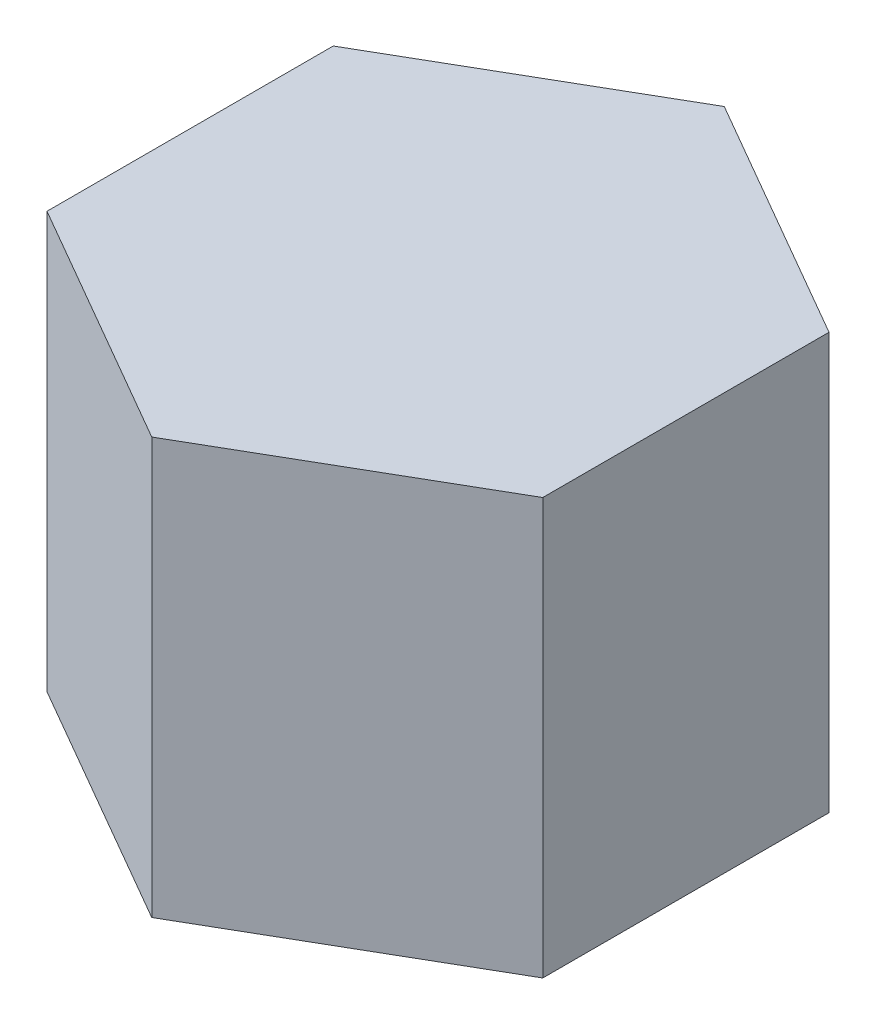
ISO-10303-21;
HEADER;
FILE_DESCRIPTION(('STEP AP214'),'2;1');
FILE_NAME('part.step','',(''),(''),'','','');
FILE_SCHEMA(('AUTOMOTIVE_DESIGN { 1 0 10303 214 1 1 1 1 }'));
ENDSEC;
DATA;
#1=APPLICATION_CONTEXT('core data for automotive mechanical design processes');
#2=APPLICATION_PROTOCOL_DEFINITION('international standard','automotive_design',2000,#1);
#3=PRODUCT_CONTEXT('',#1,'mechanical');
#4=PRODUCT('Part','Part','',(#3));
#5=PRODUCT_RELATED_PRODUCT_CATEGORY('part','',(#4));
#6=PRODUCT_DEFINITION_FORMATION('','',#4);
#7=PRODUCT_DEFINITION_CONTEXT('part definition',#1,'design');
#8=PRODUCT_DEFINITION('design','',#6,#7);
#9=PRODUCT_DEFINITION_SHAPE('','',#8);
#10=(LENGTH_UNIT() NAMED_UNIT(*) SI_UNIT(.MILLI.,.METRE.));
#11=(NAMED_UNIT(*) PLANE_ANGLE_UNIT() SI_UNIT($,.RADIAN.));
#12=(NAMED_UNIT(*) SI_UNIT($,.STERADIAN.) SOLID_ANGLE_UNIT());
#13=UNCERTAINTY_MEASURE_WITH_UNIT(LENGTH_MEASURE(1.E-05),#10,'distance_accuracy_value','');
#14=(GEOMETRIC_REPRESENTATION_CONTEXT(3) GLOBAL_UNCERTAINTY_ASSIGNED_CONTEXT((#13)) GLOBAL_UNIT_ASSIGNED_CONTEXT((#10,
#11,#12)) REPRESENTATION_CONTEXT('',''));
#15=CARTESIAN_POINT('',(0.,0.,0.));
#16=DIRECTION('',(0.,0.,1.));
#17=DIRECTION('',(1.,0.,0.));
#18=AXIS2_PLACEMENT_3D('',#15,#16,#17);
#19=CARTESIAN_POINT('',(206.339551417382,-147.556598747966,288.217869605357));
#20=DIRECTION('',(-0.499999999999943,0.,-0.866025403784471));
#21=DIRECTION('',(-0.866025403784471,0.,0.499999999999943));
#22=AXIS2_PLACEMENT_3D('',#19,#20,#21);
#23=PLANE('',#22);
#24=CARTESIAN_POINT('',(206.642660308706,-147.047793579175,288.042869605357));
#25=DIRECTION('',(-0.866025403784471,0.,0.499999999999943));
#26=VECTOR('',#25,1.);
#27=LINE('',#24,#26);
#28=CARTESIAN_POINT('',(206.642660308706,-147.047793579175,288.042869605357));
#29=VERTEX_POINT('',#28);
#30=CARTESIAN_POINT('',(206.339551417382,-147.047793579175,288.217869605357));
#31=VERTEX_POINT('',#30);
#32=EDGE_CURVE('E170',#29,#31,#27,.T.);
#33=ORIENTED_EDGE('',*,*,#32,.T.);
#34=CARTESIAN_POINT('',(206.339551417382,-147.556598747966,288.217869605357));
#35=DIRECTION('',(0.,1.,0.));
#36=VECTOR('',#35,1.);
#37=LINE('',#34,#36);
#38=CARTESIAN_POINT('',(206.339551417382,-147.556598747966,288.217869605357));
#39=VERTEX_POINT('',#38);
#40=EDGE_CURVE('E35',#39,#31,#37,.T.);
#41=ORIENTED_EDGE('',*,*,#40,.F.);
#42=CARTESIAN_POINT('',(206.642660308706,-147.556598747966,288.042869605357));
#43=DIRECTION('',(-0.866025403784471,0.,0.499999999999943));
#44=VECTOR('',#43,1.);
#45=LINE('',#42,#44);
#46=CARTESIAN_POINT('',(206.642660308706,-147.556598747966,288.042869605357));
#47=VERTEX_POINT('',#46);
#48=EDGE_CURVE('E159',#47,#39,#45,.T.);
#49=ORIENTED_EDGE('',*,*,#48,.F.);
#50=CARTESIAN_POINT('',(206.642660308706,-147.556598747966,288.042869605357));
#51=DIRECTION('',(0.,1.,0.));
#52=VECTOR('',#51,1.);
#53=LINE('',#50,#52);
#54=EDGE_CURVE('E10',#47,#29,#53,.T.);
#55=ORIENTED_EDGE('',*,*,#54,.T.);
#56=EDGE_LOOP('',(#33,#41,#49,#55));
#57=FACE_BOUND('',#56,.T.);
#58=ADVANCED_FACE('F16',(#57),#23,.F.);
#59=CARTESIAN_POINT('',(206.642660308706,-147.556598747966,291.594471220494));
#60=DIRECTION('',(-1.,0.,0.));
#61=DIRECTION('',(0.,-1.,0.));
#62=AXIS2_PLACEMENT_3D('',#59,#60,#61);
#63=PLANE('',#62);
#64=CARTESIAN_POINT('',(206.642660308706,-147.047793579175,287.692869605357));
#65=DIRECTION('',(0.,0.,1.));
#66=VECTOR('',#65,1.);
#67=LINE('',#64,#66);
#68=CARTESIAN_POINT('',(206.642660308706,-147.047793579175,287.692869605357));
#69=VERTEX_POINT('',#68);
#70=EDGE_CURVE('E167',#69,#29,#67,.T.);
#71=ORIENTED_EDGE('',*,*,#70,.T.);
#72=ORIENTED_EDGE('',*,*,#54,.F.);
#73=CARTESIAN_POINT('',(206.642660308706,-147.556598747966,287.692869605357));
#74=DIRECTION('',(0.,0.,1.));
#75=VECTOR('',#74,1.);
#76=LINE('',#73,#75);
#77=CARTESIAN_POINT('',(206.642660308706,-147.556598747966,287.692869605357));
#78=VERTEX_POINT('',#77);
#79=EDGE_CURVE('E156',#78,#47,#76,.T.);
#80=ORIENTED_EDGE('',*,*,#79,.F.);
#81=CARTESIAN_POINT('',(206.642660308706,-147.556598747966,287.692869605357));
#82=DIRECTION('',(0.,1.,0.));
#83=VECTOR('',#82,1.);
#84=LINE('',#81,#83);
#85=EDGE_CURVE('E27',#78,#69,#84,.T.);
#86=ORIENTED_EDGE('',*,*,#85,.T.);
#87=EDGE_LOOP('',(#71,#72,#80,#86));
#88=FACE_BOUND('',#87,.T.);
#89=ADVANCED_FACE('F189',(#88),#63,.F.);
#90=CARTESIAN_POINT('',(206.642660308706,-147.556598747966,287.692869605357));
#91=DIRECTION('',(-0.499999999999943,0.,0.866025403784471));
#92=DIRECTION('',(0.866025403784471,0.,0.499999999999943));
#93=AXIS2_PLACEMENT_3D('',#90,#91,#92);
#94=PLANE('',#93);
#95=CARTESIAN_POINT('',(206.339551417382,-147.047793579175,287.517869605357));
#96=DIRECTION('',(0.866025403784471,0.,0.499999999999943));
#97=VECTOR('',#96,1.);
#98=LINE('',#95,#97);
#99=CARTESIAN_POINT('',(206.339551417382,-147.047793579175,287.517869605357));
#100=VERTEX_POINT('',#99);
#101=EDGE_CURVE('E163',#100,#69,#98,.T.);
#102=ORIENTED_EDGE('',*,*,#101,.T.);
#103=ORIENTED_EDGE('',*,*,#85,.F.);
#104=CARTESIAN_POINT('',(206.339551417382,-147.556598747966,287.517869605357));
#105=DIRECTION('',(0.866025403784471,0.,0.499999999999943));
#106=VECTOR('',#105,1.);
#107=LINE('',#104,#106);
#108=CARTESIAN_POINT('',(206.339551417382,-147.556598747966,287.517869605357));
#109=VERTEX_POINT('',#108);
#110=EDGE_CURVE('E106',#109,#78,#107,.T.);
#111=ORIENTED_EDGE('',*,*,#110,.F.);
#112=CARTESIAN_POINT('',(206.339551417382,-147.556598747966,287.517869605357));
#113=DIRECTION('',(0.,1.,0.));
#114=VECTOR('',#113,1.);
#115=LINE('',#112,#114);
#116=EDGE_CURVE('E94',#109,#100,#115,.T.);
#117=ORIENTED_EDGE('',*,*,#116,.T.);
#118=EDGE_LOOP('',(#102,#103,#111,#117));
#119=FACE_BOUND('',#118,.T.);
#120=ADVANCED_FACE('F198',(#119),#94,.F.);
#121=CARTESIAN_POINT('',(206.339551417382,-147.556598747966,287.517869605357));
#122=DIRECTION('',(0.499999999999978,0.,0.866025403784452));
#123=DIRECTION('',(0.866025403784452,0.,-0.499999999999978));
#124=AXIS2_PLACEMENT_3D('',#121,#122,#123);
#125=PLANE('',#124);
#126=CARTESIAN_POINT('',(206.036442526057,-147.047793579175,287.692869605357));
#127=DIRECTION('',(0.866025403784452,0.,-0.499999999999978));
#128=VECTOR('',#127,1.);
#129=LINE('',#126,#128);
#130=CARTESIAN_POINT('',(206.036442526057,-147.047793579175,287.692869605357));
#131=VERTEX_POINT('',#130);
#132=EDGE_CURVE('E162',#131,#100,#129,.T.);
#133=ORIENTED_EDGE('',*,*,#132,.T.);
#134=ORIENTED_EDGE('',*,*,#116,.F.);
#135=CARTESIAN_POINT('',(206.036442526057,-147.556598747966,287.692869605357));
#136=DIRECTION('',(0.866025403784452,0.,-0.499999999999978));
#137=VECTOR('',#136,1.);
#138=LINE('',#135,#137);
#139=CARTESIAN_POINT('',(206.036442526057,-147.556598747966,287.692869605357));
#140=VERTEX_POINT('',#139);
#141=EDGE_CURVE('E98',#140,#109,#138,.T.);
#142=ORIENTED_EDGE('',*,*,#141,.F.);
#143=CARTESIAN_POINT('',(206.036442526057,-147.556598747966,287.692869605357));
#144=DIRECTION('',(0.,1.,0.));
#145=VECTOR('',#144,1.);
#146=LINE('',#143,#145);
#147=EDGE_CURVE('E79',#140,#131,#146,.T.);
#148=ORIENTED_EDGE('',*,*,#147,.T.);
#149=EDGE_LOOP('',(#133,#134,#142,#148));
#150=FACE_BOUND('',#149,.T.);
#151=ADVANCED_FACE('F100',(#150),#125,.F.);
#152=CARTESIAN_POINT('',(206.036442526057,-147.556598747966,291.594471220494));
#153=DIRECTION('',(1.,0.,0.));
#154=DIRECTION('',(0.,1.,0.));
#155=AXIS2_PLACEMENT_3D('',#152,#153,#154);
#156=PLANE('',#155);
#157=CARTESIAN_POINT('',(206.036442526057,-147.047793579175,288.042869605357));
#158=DIRECTION('',(0.,0.,-1.));
#159=VECTOR('',#158,1.);
#160=LINE('',#157,#159);
#161=CARTESIAN_POINT('',(206.036442526057,-147.047793579175,288.042869605357));
#162=VERTEX_POINT('',#161);
#163=EDGE_CURVE('E88',#162,#131,#160,.T.);
#164=ORIENTED_EDGE('',*,*,#163,.T.);
#165=ORIENTED_EDGE('',*,*,#147,.F.);
#166=CARTESIAN_POINT('',(206.036442526057,-147.556598747966,288.042869605357));
#167=DIRECTION('',(0.,0.,-1.));
#168=VECTOR('',#167,1.);
#169=LINE('',#166,#168);
#170=CARTESIAN_POINT('',(206.036442526057,-147.556598747966,288.042869605357));
#171=VERTEX_POINT('',#170);
#172=EDGE_CURVE('E84',#171,#140,#169,.T.);
#173=ORIENTED_EDGE('',*,*,#172,.F.);
#174=CARTESIAN_POINT('',(206.036442526057,-147.556598747966,288.042869605357));
#175=DIRECTION('',(0.,1.,0.));
#176=VECTOR('',#175,1.);
#177=LINE('',#174,#176);
#178=EDGE_CURVE('E58',#171,#162,#177,.T.);
#179=ORIENTED_EDGE('',*,*,#178,.T.);
#180=EDGE_LOOP('',(#164,#165,#173,#179));
#181=FACE_BOUND('',#180,.T.);
#182=ADVANCED_FACE('F82',(#181),#156,.F.);
#183=CARTESIAN_POINT('',(206.036442526057,-147.556598747966,288.042869605357));
#184=DIRECTION('',(0.499999999999978,0.,-0.866025403784452));
#185=DIRECTION('',(-0.866025403784452,0.,-0.499999999999978));
#186=AXIS2_PLACEMENT_3D('',#183,#184,#185);
#187=PLANE('',#186);
#188=CARTESIAN_POINT('',(206.339551417382,-147.047793579175,288.217869605357));
#189=DIRECTION('',(-0.866025403784452,0.,-0.499999999999978));
#190=VECTOR('',#189,1.);
#191=LINE('',#188,#190);
#192=EDGE_CURVE('E160',#31,#162,#191,.T.);
#193=ORIENTED_EDGE('',*,*,#192,.T.);
#194=ORIENTED_EDGE('',*,*,#178,.F.);
#195=CARTESIAN_POINT('',(206.339551417382,-147.556598747966,288.217869605357));
#196=DIRECTION('',(-0.866025403784452,0.,-0.499999999999978));
#197=VECTOR('',#196,1.);
#198=LINE('',#195,#197);
#199=EDGE_CURVE('E112',#39,#171,#198,.T.);
#200=ORIENTED_EDGE('',*,*,#199,.F.);
#201=ORIENTED_EDGE('',*,*,#40,.T.);
#202=EDGE_LOOP('',(#193,#194,#200,#201));
#203=FACE_BOUND('',#202,.T.);
#204=ADVANCED_FACE('F131',(#203),#187,.F.);
#205=CARTESIAN_POINT('',(206.491105863044,-147.556598747966,291.594471220494));
#206=DIRECTION('',(0.,1.,0.));
#207=DIRECTION('',(-1.,0.,0.));
#208=AXIS2_PLACEMENT_3D('',#205,#206,#207);
#209=PLANE('',#208);
#210=ORIENTED_EDGE('',*,*,#48,.T.);
#211=ORIENTED_EDGE('',*,*,#199,.T.);
#212=ORIENTED_EDGE('',*,*,#172,.T.);
#213=ORIENTED_EDGE('',*,*,#141,.T.);
#214=ORIENTED_EDGE('',*,*,#110,.T.);
#215=ORIENTED_EDGE('',*,*,#79,.T.);
#216=EDGE_LOOP('',(#210,#211,#212,#213,#214,#215));
#217=FACE_BOUND('',#216,.T.);
#218=ADVANCED_FACE('F111',(#217),#209,.F.);
#219=CARTESIAN_POINT('',(206.491105863044,-147.047793579175,291.594471220494));
#220=DIRECTION('',(0.,1.,0.));
#221=DIRECTION('',(-1.,0.,0.));
#222=AXIS2_PLACEMENT_3D('',#219,#220,#221);
#223=PLANE('',#222);
#224=ORIENTED_EDGE('',*,*,#32,.F.);
#225=ORIENTED_EDGE('',*,*,#70,.F.);
#226=ORIENTED_EDGE('',*,*,#101,.F.);
#227=ORIENTED_EDGE('',*,*,#132,.F.);
#228=ORIENTED_EDGE('',*,*,#163,.F.);
#229=ORIENTED_EDGE('',*,*,#192,.F.);
#230=EDGE_LOOP('',(#224,#225,#226,#227,#228,#229));
#231=FACE_BOUND('',#230,.T.);
#232=ADVANCED_FACE('F130',(#231),#223,.T.);
#233=CLOSED_SHELL('',(#58,#89,#120,#151,#182,#204,#218,#232));
#234=MANIFOLD_SOLID_BREP('B1',#233);
#235=ADVANCED_BREP_SHAPE_REPRESENTATION('',(#18,#234),#14);
#236=SHAPE_DEFINITION_REPRESENTATION(#9,#235);
ENDSEC;
END-ISO-10303-21;
